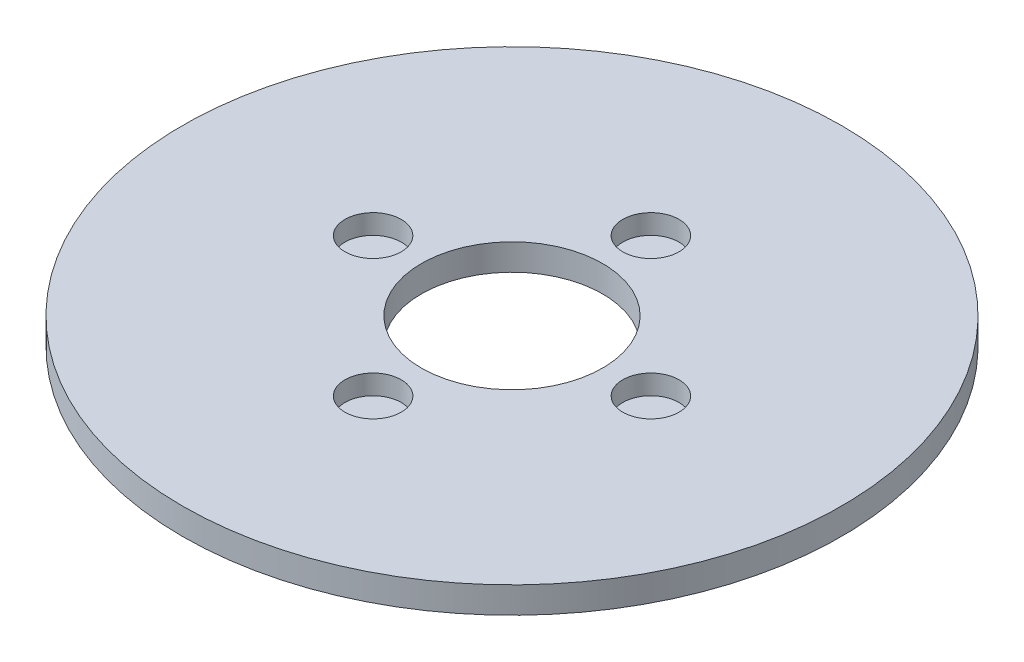
ISO-10303-21;
HEADER;
FILE_DESCRIPTION(('STEP AP214'),'2;1');
FILE_NAME('part.step','',(''),(''),'','','');
FILE_SCHEMA(('AUTOMOTIVE_DESIGN { 1 0 10303 214 1 1 1 1 }'));
ENDSEC;
DATA;
#1=APPLICATION_CONTEXT('core data for automotive mechanical design processes');
#2=APPLICATION_PROTOCOL_DEFINITION('international standard','automotive_design',2000,#1);
#3=PRODUCT_CONTEXT('',#1,'mechanical');
#4=PRODUCT('Part','Part','',(#3));
#5=PRODUCT_RELATED_PRODUCT_CATEGORY('part','',(#4));
#6=PRODUCT_DEFINITION_FORMATION('','',#4);
#7=PRODUCT_DEFINITION_CONTEXT('part definition',#1,'design');
#8=PRODUCT_DEFINITION('design','',#6,#7);
#9=PRODUCT_DEFINITION_SHAPE('','',#8);
#10=(LENGTH_UNIT() NAMED_UNIT(*) SI_UNIT(.MILLI.,.METRE.));
#11=(NAMED_UNIT(*) PLANE_ANGLE_UNIT() SI_UNIT($,.RADIAN.));
#12=(NAMED_UNIT(*) SI_UNIT($,.STERADIAN.) SOLID_ANGLE_UNIT());
#13=UNCERTAINTY_MEASURE_WITH_UNIT(LENGTH_MEASURE(1.E-05),#10,'distance_accuracy_value','');
#14=(GEOMETRIC_REPRESENTATION_CONTEXT(3) GLOBAL_UNCERTAINTY_ASSIGNED_CONTEXT((#13)) GLOBAL_UNIT_ASSIGNED_CONTEXT((#10,
#11,#12)) REPRESENTATION_CONTEXT('',''));
#15=CARTESIAN_POINT('',(0.,0.,0.));
#16=DIRECTION('',(0.,0.,1.));
#17=DIRECTION('',(1.,0.,0.));
#18=AXIS2_PLACEMENT_3D('',#15,#16,#17);
#19=CARTESIAN_POINT('',(0.,8.,0.));
#20=DIRECTION('',(0.,-1.,0.));
#21=DIRECTION('',(0.,0.,-1.));
#22=AXIS2_PLACEMENT_3D('',#19,#20,#21);
#23=CYLINDRICAL_SURFACE('',#22,100.);
#24=CARTESIAN_POINT('',(0.,8.,0.));
#25=DIRECTION('',(0.,1.,0.));
#26=DIRECTION('',(0.,0.,1.));
#27=AXIS2_PLACEMENT_3D('',#24,#25,#26);
#28=CIRCLE('',#27,100.);
#29=CARTESIAN_POINT('',(0.,8.,100.));
#30=VERTEX_POINT('',#29);
#31=EDGE_CURVE('E10',#30,#30,#28,.T.);
#32=ORIENTED_EDGE('',*,*,#31,.F.);
#33=EDGE_LOOP('',(#32));
#34=FACE_BOUND('',#33,.T.);
#35=CARTESIAN_POINT('',(0.,0.,0.));
#36=DIRECTION('',(0.,1.,0.));
#37=DIRECTION('',(0.,0.,1.));
#38=AXIS2_PLACEMENT_3D('',#35,#36,#37);
#39=CIRCLE('',#38,100.);
#40=CARTESIAN_POINT('',(0.,0.,100.));
#41=VERTEX_POINT('',#40);
#42=EDGE_CURVE('E37',#41,#41,#39,.T.);
#43=ORIENTED_EDGE('',*,*,#42,.T.);
#44=EDGE_LOOP('',(#43));
#45=FACE_BOUND('',#44,.T.);
#46=ADVANCED_FACE('F40',(#34,#45),#23,.T.);
#47=CARTESIAN_POINT('',(0.,8.,0.));
#48=DIRECTION('',(0.,1.,0.));
#49=DIRECTION('',(0.,0.,1.));
#50=AXIS2_PLACEMENT_3D('',#47,#48,#49);
#51=PLANE('',#50);
#52=CARTESIAN_POINT('',(1.47155885556642E-13,8.,42.1471207419943));
#53=DIRECTION('',(0.,1.,0.));
#54=DIRECTION('',(1.,0.,0.));
#55=AXIS2_PLACEMENT_3D('',#52,#53,#54);
#56=CIRCLE('',#55,8.53570797036295);
#57=CARTESIAN_POINT('',(8.5357079703631,8.,42.1471207419943));
#58=VERTEX_POINT('',#57);
#59=EDGE_CURVE('E71',#58,#58,#56,.T.);
#60=ORIENTED_EDGE('',*,*,#59,.F.);
#61=EDGE_LOOP('',(#60));
#62=FACE_BOUND('',#61,.T.);
#63=CARTESIAN_POINT('',(42.1471207419943,8.,0.));
#64=DIRECTION('',(0.,1.,0.));
#65=DIRECTION('',(0.,0.,-1.));
#66=AXIS2_PLACEMENT_3D('',#63,#64,#65);
#67=CIRCLE('',#66,8.53570797036295);
#68=CARTESIAN_POINT('',(42.1471207419943,8.,-8.53570797036295));
#69=VERTEX_POINT('',#68);
#70=EDGE_CURVE('E70',#69,#69,#67,.T.);
#71=ORIENTED_EDGE('',*,*,#70,.F.);
#72=EDGE_LOOP('',(#71));
#73=FACE_BOUND('',#72,.T.);
#74=CARTESIAN_POINT('',(-4.41467656669925E-13,8.,-42.1471207419943));
#75=DIRECTION('',(0.,1.,0.));
#76=DIRECTION('',(-1.,0.,0.));
#77=AXIS2_PLACEMENT_3D('',#74,#75,#76);
#78=CIRCLE('',#77,8.53570797036295);
#79=CARTESIAN_POINT('',(-8.53570797036339,8.,-42.1471207419942));
#80=VERTEX_POINT('',#79);
#81=EDGE_CURVE('E61',#80,#80,#78,.T.);
#82=ORIENTED_EDGE('',*,*,#81,.F.);
#83=EDGE_LOOP('',(#82));
#84=FACE_BOUND('',#83,.T.);
#85=CARTESIAN_POINT('',(-42.1471207419943,8.,0.));
#86=DIRECTION('',(0.,1.,0.));
#87=DIRECTION('',(0.,0.,1.));
#88=AXIS2_PLACEMENT_3D('',#85,#86,#87);
#89=CIRCLE('',#88,8.53570797036295);
#90=CARTESIAN_POINT('',(-42.1471207419943,8.,8.53570797036295));
#91=VERTEX_POINT('',#90);
#92=EDGE_CURVE('E54',#91,#91,#89,.T.);
#93=ORIENTED_EDGE('',*,*,#92,.F.);
#94=EDGE_LOOP('',(#93));
#95=FACE_BOUND('',#94,.T.);
#96=CARTESIAN_POINT('',(0.,8.,0.));
#97=DIRECTION('',(0.,1.,0.));
#98=DIRECTION('',(0.,0.,1.));
#99=AXIS2_PLACEMENT_3D('',#96,#97,#98);
#100=CIRCLE('',#99,27.5);
#101=CARTESIAN_POINT('',(0.,8.,27.5));
#102=VERTEX_POINT('',#101);
#103=EDGE_CURVE('E50',#102,#102,#100,.T.);
#104=ORIENTED_EDGE('',*,*,#103,.F.);
#105=EDGE_LOOP('',(#104));
#106=FACE_BOUND('',#105,.T.);
#107=ORIENTED_EDGE('',*,*,#31,.T.);
#108=EDGE_LOOP('',(#107));
#109=FACE_BOUND('',#108,.T.);
#110=ADVANCED_FACE('F86',(#62,#73,#84,#95,#106,#109),#51,.T.);
#111=CARTESIAN_POINT('',(0.,0.,0.));
#112=DIRECTION('',(0.,1.,0.));
#113=DIRECTION('',(0.,0.,1.));
#114=AXIS2_PLACEMENT_3D('',#111,#112,#113);
#115=PLANE('',#114);
#116=CARTESIAN_POINT('',(0.,0.,0.));
#117=DIRECTION('',(0.,1.,0.));
#118=DIRECTION('',(0.,0.,1.));
#119=AXIS2_PLACEMENT_3D('',#116,#117,#118);
#120=CIRCLE('',#119,27.5);
#121=CARTESIAN_POINT('',(0.,0.,27.5));
#122=VERTEX_POINT('',#121);
#123=EDGE_CURVE('E47',#122,#122,#120,.T.);
#124=ORIENTED_EDGE('',*,*,#123,.T.);
#125=EDGE_LOOP('',(#124));
#126=FACE_BOUND('',#125,.T.);
#127=ORIENTED_EDGE('',*,*,#42,.F.);
#128=EDGE_LOOP('',(#127));
#129=FACE_BOUND('',#128,.T.);
#130=ADVANCED_FACE('F93',(#126,#129),#115,.F.);
#131=CARTESIAN_POINT('',(0.,8.,0.));
#132=DIRECTION('',(0.,-1.,0.));
#133=DIRECTION('',(0.,0.,-1.));
#134=AXIS2_PLACEMENT_3D('',#131,#132,#133);
#135=CYLINDRICAL_SURFACE('',#134,27.5);
#136=ORIENTED_EDGE('',*,*,#103,.T.);
#137=EDGE_LOOP('',(#136));
#138=FACE_BOUND('',#137,.T.);
#139=ORIENTED_EDGE('',*,*,#123,.F.);
#140=EDGE_LOOP('',(#139));
#141=FACE_BOUND('',#140,.T.);
#142=ADVANCED_FACE('F101',(#138,#141),#135,.F.);
#143=CARTESIAN_POINT('',(-42.1471207419943,2.02247619730763,0.));
#144=DIRECTION('',(0.,1.,0.));
#145=DIRECTION('',(0.,0.,1.));
#146=AXIS2_PLACEMENT_3D('',#143,#144,#145);
#147=CYLINDRICAL_SURFACE('',#146,8.53570797036295);
#148=CARTESIAN_POINT('',(-42.1471207419943,2.02247619730763,0.));
#149=DIRECTION('',(0.,1.,0.));
#150=DIRECTION('',(0.,0.,1.));
#151=AXIS2_PLACEMENT_3D('',#148,#149,#150);
#152=CIRCLE('',#151,8.53570797036295);
#153=CARTESIAN_POINT('',(-42.1471207419943,2.02247619730763,8.53570797036295));
#154=VERTEX_POINT('',#153);
#155=EDGE_CURVE('E55',#154,#154,#152,.T.);
#156=ORIENTED_EDGE('',*,*,#155,.F.);
#157=EDGE_LOOP('',(#156));
#158=FACE_BOUND('',#157,.T.);
#159=ORIENTED_EDGE('',*,*,#92,.T.);
#160=EDGE_LOOP('',(#159));
#161=FACE_BOUND('',#160,.T.);
#162=ADVANCED_FACE('F102',(#158,#161),#147,.F.);
#163=CARTESIAN_POINT('',(-42.1471207419943,2.02247619730763,0.));
#164=DIRECTION('',(0.,1.,0.));
#165=DIRECTION('',(0.,0.,1.));
#166=AXIS2_PLACEMENT_3D('',#163,#164,#165);
#167=PLANE('',#166);
#168=ORIENTED_EDGE('',*,*,#155,.T.);
#169=EDGE_LOOP('',(#168));
#170=FACE_BOUND('',#169,.T.);
#171=ADVANCED_FACE('F133',(#170),#167,.T.);
#172=CARTESIAN_POINT('',(-4.41467656669925E-13,2.02247619730763,-42.1471207419943));
#173=DIRECTION('',(0.,1.,0.));
#174=DIRECTION('',(0.,0.,1.));
#175=AXIS2_PLACEMENT_3D('',#172,#173,#174);
#176=CYLINDRICAL_SURFACE('',#175,8.53570797036295);
#177=CARTESIAN_POINT('',(-4.41467656669925E-13,2.02247619730763,-42.1471207419943));
#178=DIRECTION('',(0.,1.,0.));
#179=DIRECTION('',(-1.,0.,0.));
#180=AXIS2_PLACEMENT_3D('',#177,#178,#179);
#181=CIRCLE('',#180,8.53570797036295);
#182=CARTESIAN_POINT('',(-8.53570797036339,2.02247619730763,-42.1471207419942));
#183=VERTEX_POINT('',#182);
#184=EDGE_CURVE('E63',#183,#183,#181,.T.);
#185=ORIENTED_EDGE('',*,*,#184,.F.);
#186=EDGE_LOOP('',(#185));
#187=FACE_BOUND('',#186,.T.);
#188=ORIENTED_EDGE('',*,*,#81,.T.);
#189=EDGE_LOOP('',(#188));
#190=FACE_BOUND('',#189,.T.);
#191=ADVANCED_FACE('F142',(#187,#190),#176,.F.);
#192=CARTESIAN_POINT('',(-4.41467656669925E-13,2.02247619730763,-42.1471207419943));
#193=DIRECTION('',(0.,1.,0.));
#194=DIRECTION('',(-1.,0.,0.));
#195=AXIS2_PLACEMENT_3D('',#192,#193,#194);
#196=PLANE('',#195);
#197=ORIENTED_EDGE('',*,*,#184,.T.);
#198=EDGE_LOOP('',(#197));
#199=FACE_BOUND('',#198,.T.);
#200=ADVANCED_FACE('F156',(#199),#196,.T.);
#201=CARTESIAN_POINT('',(42.1471207419943,2.02247619730763,0.));
#202=DIRECTION('',(0.,1.,0.));
#203=DIRECTION('',(0.,0.,1.));
#204=AXIS2_PLACEMENT_3D('',#201,#202,#203);
#205=CYLINDRICAL_SURFACE('',#204,8.53570797036295);
#206=CARTESIAN_POINT('',(42.1471207419943,2.02247619730763,0.));
#207=DIRECTION('',(0.,1.,0.));
#208=DIRECTION('',(0.,0.,-1.));
#209=AXIS2_PLACEMENT_3D('',#206,#207,#208);
#210=CIRCLE('',#209,8.53570797036295);
#211=CARTESIAN_POINT('',(42.1471207419943,2.02247619730763,-8.53570797036295));
#212=VERTEX_POINT('',#211);
#213=EDGE_CURVE('E69',#212,#212,#210,.T.);
#214=ORIENTED_EDGE('',*,*,#213,.F.);
#215=EDGE_LOOP('',(#214));
#216=FACE_BOUND('',#215,.T.);
#217=ORIENTED_EDGE('',*,*,#70,.T.);
#218=EDGE_LOOP('',(#217));
#219=FACE_BOUND('',#218,.T.);
#220=ADVANCED_FACE('F164',(#216,#219),#205,.F.);
#221=CARTESIAN_POINT('',(42.1471207419943,2.02247619730763,0.));
#222=DIRECTION('',(0.,1.,0.));
#223=DIRECTION('',(0.,0.,-1.));
#224=AXIS2_PLACEMENT_3D('',#221,#222,#223);
#225=PLANE('',#224);
#226=ORIENTED_EDGE('',*,*,#213,.T.);
#227=EDGE_LOOP('',(#226));
#228=FACE_BOUND('',#227,.T.);
#229=ADVANCED_FACE('F83',(#228),#225,.T.);
#230=CARTESIAN_POINT('',(1.47155885556642E-13,2.02247619730763,42.1471207419943));
#231=DIRECTION('',(0.,1.,0.));
#232=DIRECTION('',(0.,0.,1.));
#233=AXIS2_PLACEMENT_3D('',#230,#231,#232);
#234=CYLINDRICAL_SURFACE('',#233,8.53570797036295);
#235=CARTESIAN_POINT('',(1.47155885556642E-13,2.02247619730763,42.1471207419943));
#236=DIRECTION('',(0.,1.,0.));
#237=DIRECTION('',(1.,0.,0.));
#238=AXIS2_PLACEMENT_3D('',#235,#236,#237);
#239=CIRCLE('',#238,8.53570797036295);
#240=CARTESIAN_POINT('',(8.5357079703631,2.02247619730763,42.1471207419943));
#241=VERTEX_POINT('',#240);
#242=EDGE_CURVE('E59',#241,#241,#239,.T.);
#243=ORIENTED_EDGE('',*,*,#242,.F.);
#244=EDGE_LOOP('',(#243));
#245=FACE_BOUND('',#244,.T.);
#246=ORIENTED_EDGE('',*,*,#59,.T.);
#247=EDGE_LOOP('',(#246));
#248=FACE_BOUND('',#247,.T.);
#249=ADVANCED_FACE('F81',(#245,#248),#234,.F.);
#250=CARTESIAN_POINT('',(1.47155885556642E-13,2.02247619730763,42.1471207419943));
#251=DIRECTION('',(0.,1.,0.));
#252=DIRECTION('',(1.,0.,0.));
#253=AXIS2_PLACEMENT_3D('',#250,#251,#252);
#254=PLANE('',#253);
#255=ORIENTED_EDGE('',*,*,#242,.T.);
#256=EDGE_LOOP('',(#255));
#257=FACE_BOUND('',#256,.T.);
#258=ADVANCED_FACE('F78',(#257),#254,.T.);
#259=CLOSED_SHELL('',(#46,#110,#130,#142,#162,#171,#191,#200,#220,#229,#249,#258));
#260=MANIFOLD_SOLID_BREP('B2',#259);
#261=ADVANCED_BREP_SHAPE_REPRESENTATION('',(#18,#260),#14);
#262=SHAPE_DEFINITION_REPRESENTATION(#9,#261);
ENDSEC;
END-ISO-10303-21;
